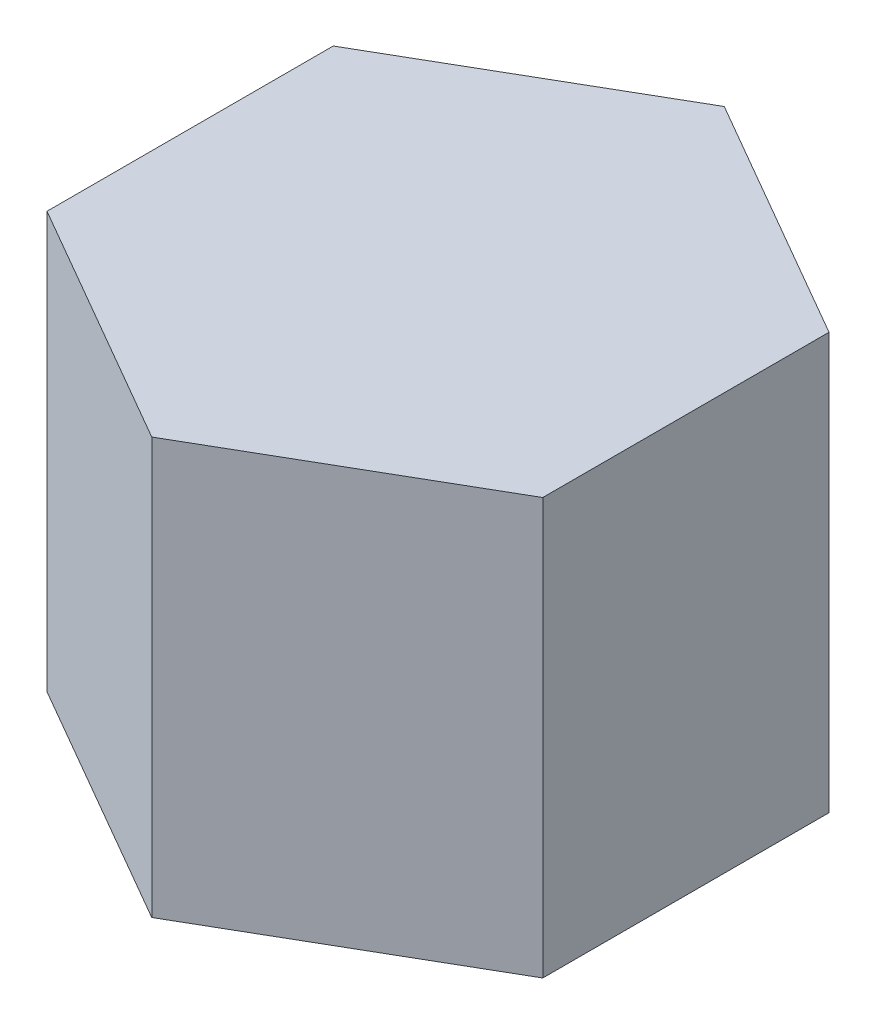
ISO-10303-21;
HEADER;
FILE_DESCRIPTION(('STEP AP214'),'2;1');
FILE_NAME('part.step','',(''),(''),'','','');
FILE_SCHEMA(('AUTOMOTIVE_DESIGN { 1 0 10303 214 1 1 1 1 }'));
ENDSEC;
DATA;
#1=APPLICATION_CONTEXT('core data for automotive mechanical design processes');
#2=APPLICATION_PROTOCOL_DEFINITION('international standard','automotive_design',2000,#1);
#3=PRODUCT_CONTEXT('',#1,'mechanical');
#4=PRODUCT('Part','Part','',(#3));
#5=PRODUCT_RELATED_PRODUCT_CATEGORY('part','',(#4));
#6=PRODUCT_DEFINITION_FORMATION('','',#4);
#7=PRODUCT_DEFINITION_CONTEXT('part definition',#1,'design');
#8=PRODUCT_DEFINITION('design','',#6,#7);
#9=PRODUCT_DEFINITION_SHAPE('','',#8);
#10=(LENGTH_UNIT() NAMED_UNIT(*) SI_UNIT(.MILLI.,.METRE.));
#11=(NAMED_UNIT(*) PLANE_ANGLE_UNIT() SI_UNIT($,.RADIAN.));
#12=(NAMED_UNIT(*) SI_UNIT($,.STERADIAN.) SOLID_ANGLE_UNIT());
#13=UNCERTAINTY_MEASURE_WITH_UNIT(LENGTH_MEASURE(1.E-05),#10,'distance_accuracy_value','');
#14=(GEOMETRIC_REPRESENTATION_CONTEXT(3) GLOBAL_UNCERTAINTY_ASSIGNED_CONTEXT((#13)) GLOBAL_UNIT_ASSIGNED_CONTEXT((#10,
#11,#12)) REPRESENTATION_CONTEXT('',''));
#15=CARTESIAN_POINT('',(0.,0.,0.));
#16=DIRECTION('',(0.,0.,1.));
#17=DIRECTION('',(1.,0.,0.));
#18=AXIS2_PLACEMENT_3D('',#15,#16,#17);
#19=CARTESIAN_POINT('',(203.839551417382,-147.556598747966,294.280047431848));
#20=DIRECTION('',(-0.500000000000096,0.,-0.866025403784383));
#21=DIRECTION('',(-0.866025403784383,0.,0.500000000000096));
#22=AXIS2_PLACEMENT_3D('',#19,#20,#21);
#23=PLANE('',#22);
#24=CARTESIAN_POINT('',(204.142660308706,-147.047793579175,294.105047431848));
#25=DIRECTION('',(-0.866025403784383,0.,0.500000000000096));
#26=VECTOR('',#25,1.);
#27=LINE('',#24,#26);
#28=CARTESIAN_POINT('',(204.142660308706,-147.047793579175,294.105047431848));
#29=VERTEX_POINT('',#28);
#30=CARTESIAN_POINT('',(203.839551417382,-147.047793579175,294.280047431848));
#31=VERTEX_POINT('',#30);
#32=EDGE_CURVE('E170',#29,#31,#27,.T.);
#33=ORIENTED_EDGE('',*,*,#32,.T.);
#34=CARTESIAN_POINT('',(203.839551417382,-147.556598747966,294.280047431848));
#35=DIRECTION('',(0.,1.,0.));
#36=VECTOR('',#35,1.);
#37=LINE('',#34,#36);
#38=CARTESIAN_POINT('',(203.839551417382,-147.556598747966,294.280047431848));
#39=VERTEX_POINT('',#38);
#40=EDGE_CURVE('E35',#39,#31,#37,.T.);
#41=ORIENTED_EDGE('',*,*,#40,.F.);
#42=CARTESIAN_POINT('',(204.142660308706,-147.556598747966,294.105047431848));
#43=DIRECTION('',(-0.866025403784383,0.,0.500000000000096));
#44=VECTOR('',#43,1.);
#45=LINE('',#42,#44);
#46=CARTESIAN_POINT('',(204.142660308706,-147.556598747966,294.105047431848));
#47=VERTEX_POINT('',#46);
#48=EDGE_CURVE('E159',#47,#39,#45,.T.);
#49=ORIENTED_EDGE('',*,*,#48,.F.);
#50=CARTESIAN_POINT('',(204.142660308706,-147.556598747966,294.105047431848));
#51=DIRECTION('',(0.,1.,0.));
#52=VECTOR('',#51,1.);
#53=LINE('',#50,#52);
#54=EDGE_CURVE('E10',#47,#29,#53,.T.);
#55=ORIENTED_EDGE('',*,*,#54,.T.);
#56=EDGE_LOOP('',(#33,#41,#49,#55));
#57=FACE_BOUND('',#56,.T.);
#58=ADVANCED_FACE('F16',(#57),#23,.F.);
#59=CARTESIAN_POINT('',(204.142660308706,-147.556598747966,291.594471220494));
#60=DIRECTION('',(-1.,0.,0.));
#61=DIRECTION('',(0.,-1.,0.));
#62=AXIS2_PLACEMENT_3D('',#59,#60,#61);
#63=PLANE('',#62);
#64=CARTESIAN_POINT('',(204.142660308706,-147.047793579175,293.755047431848));
#65=DIRECTION('',(0.,0.,1.));
#66=VECTOR('',#65,1.);
#67=LINE('',#64,#66);
#68=CARTESIAN_POINT('',(204.142660308706,-147.047793579175,293.755047431848));
#69=VERTEX_POINT('',#68);
#70=EDGE_CURVE('E167',#69,#29,#67,.T.);
#71=ORIENTED_EDGE('',*,*,#70,.T.);
#72=ORIENTED_EDGE('',*,*,#54,.F.);
#73=CARTESIAN_POINT('',(204.142660308706,-147.556598747966,293.755047431848));
#74=DIRECTION('',(0.,0.,1.));
#75=VECTOR('',#74,1.);
#76=LINE('',#73,#75);
#77=CARTESIAN_POINT('',(204.142660308706,-147.556598747966,293.755047431848));
#78=VERTEX_POINT('',#77);
#79=EDGE_CURVE('E156',#78,#47,#76,.T.);
#80=ORIENTED_EDGE('',*,*,#79,.F.);
#81=CARTESIAN_POINT('',(204.142660308706,-147.556598747966,293.755047431848));
#82=DIRECTION('',(0.,1.,0.));
#83=VECTOR('',#82,1.);
#84=LINE('',#81,#83);
#85=EDGE_CURVE('E27',#78,#69,#84,.T.);
#86=ORIENTED_EDGE('',*,*,#85,.T.);
#87=EDGE_LOOP('',(#71,#72,#80,#86));
#88=FACE_BOUND('',#87,.T.);
#89=ADVANCED_FACE('F189',(#88),#63,.F.);
#90=CARTESIAN_POINT('',(204.142660308706,-147.556598747966,293.755047431848));
#91=DIRECTION('',(-0.500000000000062,0.,0.866025403784403));
#92=DIRECTION('',(0.866025403784403,0.,0.500000000000062));
#93=AXIS2_PLACEMENT_3D('',#90,#91,#92);
#94=PLANE('',#93);
#95=CARTESIAN_POINT('',(203.839551417382,-147.047793579175,293.580047431848));
#96=DIRECTION('',(0.866025403784403,0.,0.500000000000062));
#97=VECTOR('',#96,1.);
#98=LINE('',#95,#97);
#99=CARTESIAN_POINT('',(203.839551417382,-147.047793579175,293.580047431848));
#100=VERTEX_POINT('',#99);
#101=EDGE_CURVE('E163',#100,#69,#98,.T.);
#102=ORIENTED_EDGE('',*,*,#101,.T.);
#103=ORIENTED_EDGE('',*,*,#85,.F.);
#104=CARTESIAN_POINT('',(203.839551417382,-147.556598747966,293.580047431848));
#105=DIRECTION('',(0.866025403784403,0.,0.500000000000062));
#106=VECTOR('',#105,1.);
#107=LINE('',#104,#106);
#108=CARTESIAN_POINT('',(203.839551417382,-147.556598747966,293.580047431848));
#109=VERTEX_POINT('',#108);
#110=EDGE_CURVE('E106',#109,#78,#107,.T.);
#111=ORIENTED_EDGE('',*,*,#110,.F.);
#112=CARTESIAN_POINT('',(203.839551417382,-147.556598747966,293.580047431848));
#113=DIRECTION('',(0.,1.,0.));
#114=VECTOR('',#113,1.);
#115=LINE('',#112,#114);
#116=EDGE_CURVE('E94',#109,#100,#115,.T.);
#117=ORIENTED_EDGE('',*,*,#116,.T.);
#118=EDGE_LOOP('',(#102,#103,#111,#117));
#119=FACE_BOUND('',#118,.T.);
#120=ADVANCED_FACE('F198',(#119),#94,.F.);
#121=CARTESIAN_POINT('',(203.839551417382,-147.556598747966,293.580047431848));
#122=DIRECTION('',(0.500000000000096,0.,0.866025403784383));
#123=DIRECTION('',(0.866025403784383,0.,-0.500000000000096));
#124=AXIS2_PLACEMENT_3D('',#121,#122,#123);
#125=PLANE('',#124);
#126=CARTESIAN_POINT('',(203.536442526057,-147.047793579175,293.755047431848));
#127=DIRECTION('',(0.866025403784383,0.,-0.500000000000096));
#128=VECTOR('',#127,1.);
#129=LINE('',#126,#128);
#130=CARTESIAN_POINT('',(203.536442526057,-147.047793579175,293.755047431848));
#131=VERTEX_POINT('',#130);
#132=EDGE_CURVE('E162',#131,#100,#129,.T.);
#133=ORIENTED_EDGE('',*,*,#132,.T.);
#134=ORIENTED_EDGE('',*,*,#116,.F.);
#135=CARTESIAN_POINT('',(203.536442526057,-147.556598747966,293.755047431848));
#136=DIRECTION('',(0.866025403784383,0.,-0.500000000000096));
#137=VECTOR('',#136,1.);
#138=LINE('',#135,#137);
#139=CARTESIAN_POINT('',(203.536442526057,-147.556598747966,293.755047431848));
#140=VERTEX_POINT('',#139);
#141=EDGE_CURVE('E98',#140,#109,#138,.T.);
#142=ORIENTED_EDGE('',*,*,#141,.F.);
#143=CARTESIAN_POINT('',(203.536442526057,-147.556598747966,293.755047431848));
#144=DIRECTION('',(0.,1.,0.));
#145=VECTOR('',#144,1.);
#146=LINE('',#143,#145);
#147=EDGE_CURVE('E79',#140,#131,#146,.T.);
#148=ORIENTED_EDGE('',*,*,#147,.T.);
#149=EDGE_LOOP('',(#133,#134,#142,#148));
#150=FACE_BOUND('',#149,.T.);
#151=ADVANCED_FACE('F100',(#150),#125,.F.);
#152=CARTESIAN_POINT('',(203.536442526057,-147.556598747966,291.594471220494));
#153=DIRECTION('',(1.,0.,0.));
#154=DIRECTION('',(0.,1.,0.));
#155=AXIS2_PLACEMENT_3D('',#152,#153,#154);
#156=PLANE('',#155);
#157=CARTESIAN_POINT('',(203.536442526057,-147.047793579175,294.105047431848));
#158=DIRECTION('',(0.,0.,-1.));
#159=VECTOR('',#158,1.);
#160=LINE('',#157,#159);
#161=CARTESIAN_POINT('',(203.536442526057,-147.047793579175,294.105047431848));
#162=VERTEX_POINT('',#161);
#163=EDGE_CURVE('E88',#162,#131,#160,.T.);
#164=ORIENTED_EDGE('',*,*,#163,.T.);
#165=ORIENTED_EDGE('',*,*,#147,.F.);
#166=CARTESIAN_POINT('',(203.536442526057,-147.556598747966,294.105047431848));
#167=DIRECTION('',(0.,0.,-1.));
#168=VECTOR('',#167,1.);
#169=LINE('',#166,#168);
#170=CARTESIAN_POINT('',(203.536442526057,-147.556598747966,294.105047431848));
#171=VERTEX_POINT('',#170);
#172=EDGE_CURVE('E84',#171,#140,#169,.T.);
#173=ORIENTED_EDGE('',*,*,#172,.F.);
#174=CARTESIAN_POINT('',(203.536442526057,-147.556598747966,294.105047431848));
#175=DIRECTION('',(0.,1.,0.));
#176=VECTOR('',#175,1.);
#177=LINE('',#174,#176);
#178=EDGE_CURVE('E58',#171,#162,#177,.T.);
#179=ORIENTED_EDGE('',*,*,#178,.T.);
#180=EDGE_LOOP('',(#164,#165,#173,#179));
#181=FACE_BOUND('',#180,.T.);
#182=ADVANCED_FACE('F82',(#181),#156,.F.);
#183=CARTESIAN_POINT('',(203.536442526057,-147.556598747966,294.105047431848));
#184=DIRECTION('',(0.499999999999978,0.,-0.866025403784452));
#185=DIRECTION('',(-0.866025403784452,0.,-0.499999999999978));
#186=AXIS2_PLACEMENT_3D('',#183,#184,#185);
#187=PLANE('',#186);
#188=CARTESIAN_POINT('',(203.839551417382,-147.047793579175,294.280047431848));
#189=DIRECTION('',(-0.866025403784452,0.,-0.499999999999978));
#190=VECTOR('',#189,1.);
#191=LINE('',#188,#190);
#192=EDGE_CURVE('E160',#31,#162,#191,.T.);
#193=ORIENTED_EDGE('',*,*,#192,.T.);
#194=ORIENTED_EDGE('',*,*,#178,.F.);
#195=CARTESIAN_POINT('',(203.839551417382,-147.556598747966,294.280047431848));
#196=DIRECTION('',(-0.866025403784452,0.,-0.499999999999978));
#197=VECTOR('',#196,1.);
#198=LINE('',#195,#197);
#199=EDGE_CURVE('E112',#39,#171,#198,.T.);
#200=ORIENTED_EDGE('',*,*,#199,.F.);
#201=ORIENTED_EDGE('',*,*,#40,.T.);
#202=EDGE_LOOP('',(#193,#194,#200,#201));
#203=FACE_BOUND('',#202,.T.);
#204=ADVANCED_FACE('F131',(#203),#187,.F.);
#205=CARTESIAN_POINT('',(206.491105863044,-147.556598747966,291.594471220494));
#206=DIRECTION('',(0.,1.,0.));
#207=DIRECTION('',(-1.,0.,0.));
#208=AXIS2_PLACEMENT_3D('',#205,#206,#207);
#209=PLANE('',#208);
#210=ORIENTED_EDGE('',*,*,#48,.T.);
#211=ORIENTED_EDGE('',*,*,#199,.T.);
#212=ORIENTED_EDGE('',*,*,#172,.T.);
#213=ORIENTED_EDGE('',*,*,#141,.T.);
#214=ORIENTED_EDGE('',*,*,#110,.T.);
#215=ORIENTED_EDGE('',*,*,#79,.T.);
#216=EDGE_LOOP('',(#210,#211,#212,#213,#214,#215));
#217=FACE_BOUND('',#216,.T.);
#218=ADVANCED_FACE('F111',(#217),#209,.F.);
#219=CARTESIAN_POINT('',(206.491105863044,-147.047793579175,291.594471220494));
#220=DIRECTION('',(0.,1.,0.));
#221=DIRECTION('',(-1.,0.,0.));
#222=AXIS2_PLACEMENT_3D('',#219,#220,#221);
#223=PLANE('',#222);
#224=ORIENTED_EDGE('',*,*,#32,.F.);
#225=ORIENTED_EDGE('',*,*,#70,.F.);
#226=ORIENTED_EDGE('',*,*,#101,.F.);
#227=ORIENTED_EDGE('',*,*,#132,.F.);
#228=ORIENTED_EDGE('',*,*,#163,.F.);
#229=ORIENTED_EDGE('',*,*,#192,.F.);
#230=EDGE_LOOP('',(#224,#225,#226,#227,#228,#229));
#231=FACE_BOUND('',#230,.T.);
#232=ADVANCED_FACE('F130',(#231),#223,.T.);
#233=CLOSED_SHELL('',(#58,#89,#120,#151,#182,#204,#218,#232));
#234=MANIFOLD_SOLID_BREP('B1',#233);
#235=ADVANCED_BREP_SHAPE_REPRESENTATION('',(#18,#234),#14);
#236=SHAPE_DEFINITION_REPRESENTATION(#9,#235);
ENDSEC;
END-ISO-10303-21;
